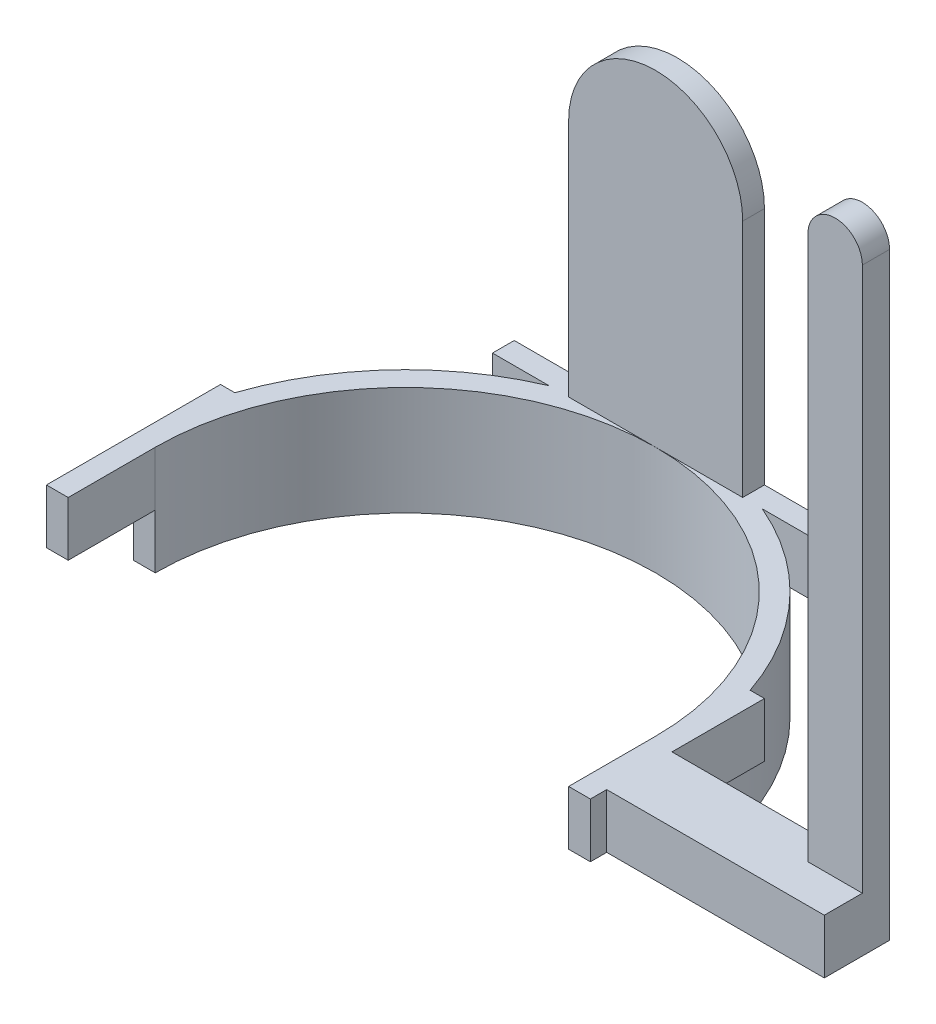
ISO-10303-21;
HEADER;
FILE_DESCRIPTION(('STEP AP214'),'2;1');
FILE_NAME('part.step','',(''),(''),'','','');
FILE_SCHEMA(('AUTOMOTIVE_DESIGN { 1 0 10303 214 1 1 1 1 }'));
ENDSEC;
DATA;
#1=APPLICATION_CONTEXT('core data for automotive mechanical design processes');
#2=APPLICATION_PROTOCOL_DEFINITION('international standard','automotive_design',2000,#1);
#3=PRODUCT_CONTEXT('',#1,'mechanical');
#4=PRODUCT('Part','Part','',(#3));
#5=PRODUCT_RELATED_PRODUCT_CATEGORY('part','',(#4));
#6=PRODUCT_DEFINITION_FORMATION('','',#4);
#7=PRODUCT_DEFINITION_CONTEXT('part definition',#1,'design');
#8=PRODUCT_DEFINITION('design','',#6,#7);
#9=PRODUCT_DEFINITION_SHAPE('','',#8);
#10=(LENGTH_UNIT() NAMED_UNIT(*) SI_UNIT(.MILLI.,.METRE.));
#11=(NAMED_UNIT(*) PLANE_ANGLE_UNIT() SI_UNIT($,.RADIAN.));
#12=(NAMED_UNIT(*) SI_UNIT($,.STERADIAN.) SOLID_ANGLE_UNIT());
#13=UNCERTAINTY_MEASURE_WITH_UNIT(LENGTH_MEASURE(1.E-05),#10,'distance_accuracy_value','');
#14=(GEOMETRIC_REPRESENTATION_CONTEXT(3) GLOBAL_UNCERTAINTY_ASSIGNED_CONTEXT((#13)) GLOBAL_UNIT_ASSIGNED_CONTEXT((#10,
#11,#12)) REPRESENTATION_CONTEXT('',''));
#15=CARTESIAN_POINT('',(0.,0.,0.));
#16=DIRECTION('',(0.,0.,1.));
#17=DIRECTION('',(1.,0.,0.));
#18=AXIS2_PLACEMENT_3D('',#15,#16,#17);
#19=CARTESIAN_POINT('',(0.,20.,0.));
#20=DIRECTION('',(0.,-1.,0.));
#21=DIRECTION('',(0.,0.,-1.));
#22=AXIS2_PLACEMENT_3D('',#19,#20,#21);
#23=PLANE('',#22);
#24=DIRECTION('',(0.,0.,1.));
#25=VECTOR('',#24,1.);
#26=CARTESIAN_POINT('',(80.,20.,1.));
#27=LINE('',#26,#25);
#28=CARTESIAN_POINT('',(80.,20.,1.));
#29=VERTEX_POINT('',#28);
#30=CARTESIAN_POINT('',(80.,20.,6.));
#31=VERTEX_POINT('',#30);
#32=EDGE_CURVE('E267',#29,#31,#27,.T.);
#33=ORIENTED_EDGE('',*,*,#32,.F.);
#34=DIRECTION('',(-1.,0.,0.));
#35=VECTOR('',#34,1.);
#36=CARTESIAN_POINT('',(90.,20.,0.999999999999999));
#37=LINE('',#36,#35);
#38=CARTESIAN_POINT('',(50.,20.,1.));
#39=VERTEX_POINT('',#38);
#40=EDGE_CURVE('E63',#29,#39,#37,.T.);
#41=ORIENTED_EDGE('',*,*,#40,.T.);
#42=DIRECTION('',(0.,0.,-1.));
#43=VECTOR('',#42,1.);
#44=CARTESIAN_POINT('',(50.,20.,-16.));
#45=LINE('',#44,#43);
#46=CARTESIAN_POINT('',(50.,20.,-16.));
#47=VERTEX_POINT('',#46);
#48=EDGE_CURVE('E344',#39,#47,#45,.T.);
#49=ORIENTED_EDGE('',*,*,#48,.T.);
#50=DIRECTION('',(-1.,0.,0.));
#51=VECTOR('',#50,1.);
#52=CARTESIAN_POINT('',(50.,20.,-16.));
#53=LINE('',#52,#51);
#54=CARTESIAN_POINT('',(47.370877129308,20.,-16.));
#55=VERTEX_POINT('',#54);
#56=EDGE_CURVE('E348',#47,#55,#53,.T.);
#57=ORIENTED_EDGE('',*,*,#56,.T.);
#58=CARTESIAN_POINT('',(0.,20.,0.));
#59=DIRECTION('',(0.,1.,0.));
#60=DIRECTION('',(0.,0.,-1.));
#61=AXIS2_PLACEMENT_3D('',#58,#59,#60);
#62=CIRCLE('',#61,50.);
#63=CARTESIAN_POINT('',(19.5959179422654,20.,-46.));
#64=VERTEX_POINT('',#63);
#65=EDGE_CURVE('E350',#55,#64,#62,.T.);
#66=ORIENTED_EDGE('',*,*,#65,.T.);
#67=DIRECTION('',(1.,0.,0.));
#68=VECTOR('',#67,1.);
#69=CARTESIAN_POINT('',(19.5959179422654,20.,-46.));
#70=LINE('',#69,#68);
#71=CARTESIAN_POINT('',(30.,20.,-46.));
#72=VERTEX_POINT('',#71);
#73=EDGE_CURVE('E352',#64,#72,#70,.T.);
#74=ORIENTED_EDGE('',*,*,#73,.T.);
#75=DIRECTION('',(0.,0.,-1.));
#76=VECTOR('',#75,1.);
#77=CARTESIAN_POINT('',(30.,20.,-50.));
#78=LINE('',#77,#76);
#79=CARTESIAN_POINT('',(30.,20.,-50.));
#80=VERTEX_POINT('',#79);
#81=EDGE_CURVE('E354',#72,#80,#78,.T.);
#82=ORIENTED_EDGE('',*,*,#81,.T.);
#83=DIRECTION('',(-1.,0.,0.));
#84=VECTOR('',#83,1.);
#85=CARTESIAN_POINT('',(-30.,20.,-50.));
#86=LINE('',#85,#84);
#87=CARTESIAN_POINT('',(16.,20.,-50.));
#88=VERTEX_POINT('',#87);
#89=EDGE_CURVE('E357',#80,#88,#86,.T.);
#90=ORIENTED_EDGE('',*,*,#89,.T.);
#91=DIRECTION('',(0.,0.,-1.));
#92=VECTOR('',#91,1.);
#93=CARTESIAN_POINT('',(16.,20.,-50.));
#94=LINE('',#93,#92);
#95=CARTESIAN_POINT('',(16.,20.,-46.));
#96=VERTEX_POINT('',#95);
#97=EDGE_CURVE('E312',#96,#88,#94,.T.);
#98=ORIENTED_EDGE('',*,*,#97,.F.);
#99=DIRECTION('',(1.,0.,0.));
#100=VECTOR('',#99,1.);
#101=CARTESIAN_POINT('',(-16.,20.,-46.));
#102=LINE('',#101,#100);
#103=CARTESIAN_POINT('',(0.,20.,-46.));
#104=VERTEX_POINT('',#103);
#105=EDGE_CURVE('E11',#104,#96,#102,.T.);
#106=ORIENTED_EDGE('',*,*,#105,.F.);
#107=CARTESIAN_POINT('',(0.,20.,0.));
#108=DIRECTION('',(0.,-1.,0.));
#109=DIRECTION('',(0.,0.,-1.));
#110=AXIS2_PLACEMENT_3D('',#107,#108,#109);
#111=CIRCLE('',#110,46.);
#112=CARTESIAN_POINT('',(46.,20.,0.));
#113=VERTEX_POINT('',#112);
#114=EDGE_CURVE('E336',#104,#113,#111,.T.);
#115=ORIENTED_EDGE('',*,*,#114,.T.);
#116=DIRECTION('',(0.,0.,1.));
#117=VECTOR('',#116,1.);
#118=CARTESIAN_POINT('',(46.,20.,0.));
#119=LINE('',#118,#117);
#120=CARTESIAN_POINT('',(46.,20.,16.));
#121=VERTEX_POINT('',#120);
#122=EDGE_CURVE('E340',#113,#121,#119,.T.);
#123=ORIENTED_EDGE('',*,*,#122,.T.);
#124=DIRECTION('',(1.,0.,0.));
#125=VECTOR('',#124,1.);
#126=CARTESIAN_POINT('',(50.,20.,16.));
#127=LINE('',#126,#125);
#128=CARTESIAN_POINT('',(50.,20.,16.));
#129=VERTEX_POINT('',#128);
#130=EDGE_CURVE('E342',#121,#129,#127,.T.);
#131=ORIENTED_EDGE('',*,*,#130,.T.);
#132=CARTESIAN_POINT('',(50.,20.,13.));
#133=VERTEX_POINT('',#132);
#134=EDGE_CURVE('E345',#129,#133,#45,.T.);
#135=ORIENTED_EDGE('',*,*,#134,.T.);
#136=DIRECTION('',(-1.,0.,0.));
#137=VECTOR('',#136,1.);
#138=CARTESIAN_POINT('',(90.,20.,13.));
#139=LINE('',#138,#137);
#140=CARTESIAN_POINT('',(90.,20.,13.));
#141=VERTEX_POINT('',#140);
#142=EDGE_CURVE('E286',#141,#133,#139,.T.);
#143=ORIENTED_EDGE('',*,*,#142,.F.);
#144=DIRECTION('',(0.,0.,1.));
#145=VECTOR('',#144,1.);
#146=CARTESIAN_POINT('',(90.,20.,13.));
#147=LINE('',#146,#145);
#148=CARTESIAN_POINT('',(90.,20.,6.));
#149=VERTEX_POINT('',#148);
#150=EDGE_CURVE('E284',#149,#141,#147,.T.);
#151=ORIENTED_EDGE('',*,*,#150,.F.);
#152=DIRECTION('',(1.,0.,0.));
#153=VECTOR('',#152,1.);
#154=CARTESIAN_POINT('',(90.,20.,6.));
#155=LINE('',#154,#153);
#156=EDGE_CURVE('E270',#31,#149,#155,.T.);
#157=ORIENTED_EDGE('',*,*,#156,.F.);
#158=EDGE_LOOP('',(#33,#41,#49,#57,#66,#74,#82,#90,#98,#106,#115,#123,#131,#135,#143,#151,#157));
#159=FACE_BOUND('',#158,.T.);
#160=ADVANCED_FACE('F38',(#159),#23,.F.);
#161=CARTESIAN_POINT('',(50.,20.,-16.));
#162=DIRECTION('',(-1.,0.,0.));
#163=DIRECTION('',(0.,0.,1.));
#164=AXIS2_PLACEMENT_3D('',#161,#162,#163);
#165=PLANE('',#164);
#166=DIRECTION('',(0.,-1.,0.));
#167=VECTOR('',#166,1.);
#168=CARTESIAN_POINT('',(50.,20.,13.));
#169=LINE('',#168,#167);
#170=CARTESIAN_POINT('',(50.,10.,13.));
#171=VERTEX_POINT('',#170);
#172=EDGE_CURVE('E261',#133,#171,#169,.T.);
#173=ORIENTED_EDGE('',*,*,#172,.F.);
#174=ORIENTED_EDGE('',*,*,#134,.F.);
#175=DIRECTION('',(0.,-1.,0.));
#176=VECTOR('',#175,1.);
#177=CARTESIAN_POINT('',(50.,20.,16.));
#178=LINE('',#177,#176);
#179=CARTESIAN_POINT('',(50.,10.,16.));
#180=VERTEX_POINT('',#179);
#181=EDGE_CURVE('E421',#129,#180,#178,.T.);
#182=ORIENTED_EDGE('',*,*,#181,.T.);
#183=DIRECTION('',(0.,0.,-1.));
#184=VECTOR('',#183,1.);
#185=CARTESIAN_POINT('',(50.,10.,-16.));
#186=LINE('',#185,#184);
#187=EDGE_CURVE('E380',#180,#171,#186,.T.);
#188=ORIENTED_EDGE('',*,*,#187,.T.);
#189=EDGE_LOOP('',(#173,#174,#182,#188));
#190=FACE_BOUND('',#189,.T.);
#191=ADVANCED_FACE('F507',(#190),#165,.F.);
#192=DIRECTION('',(0.,1.,0.));
#193=VECTOR('',#192,1.);
#194=CARTESIAN_POINT('',(50.,20.,0.999999999999999));
#195=LINE('',#194,#193);
#196=CARTESIAN_POINT('',(50.,10.,0.999999999999997));
#197=VERTEX_POINT('',#196);
#198=EDGE_CURVE('E280',#197,#39,#195,.T.);
#199=ORIENTED_EDGE('',*,*,#198,.F.);
#200=CARTESIAN_POINT('',(50.,10.,0.));
#201=VERTEX_POINT('',#200);
#202=EDGE_CURVE('E383',#197,#201,#186,.T.);
#203=ORIENTED_EDGE('',*,*,#202,.T.);
#204=CARTESIAN_POINT('',(50.,10.,-16.));
#205=VERTEX_POINT('',#204);
#206=EDGE_CURVE('E379',#201,#205,#186,.T.);
#207=ORIENTED_EDGE('',*,*,#206,.T.);
#208=DIRECTION('',(0.,-1.,0.));
#209=VECTOR('',#208,1.);
#210=CARTESIAN_POINT('',(50.,20.,-16.));
#211=LINE('',#210,#209);
#212=EDGE_CURVE('E418',#47,#205,#211,.T.);
#213=ORIENTED_EDGE('',*,*,#212,.F.);
#214=ORIENTED_EDGE('',*,*,#48,.F.);
#215=EDGE_LOOP('',(#199,#203,#207,#213,#214));
#216=FACE_BOUND('',#215,.T.);
#217=ADVANCED_FACE('F521',(#216),#165,.F.);
#218=CARTESIAN_POINT('',(-16.,80.,-50.));
#219=DIRECTION('',(1.,0.,0.));
#220=DIRECTION('',(0.,0.,-1.));
#221=AXIS2_PLACEMENT_3D('',#218,#219,#220);
#222=PLANE('',#221);
#223=DIRECTION('',(0.,0.,-1.));
#224=VECTOR('',#223,1.);
#225=CARTESIAN_POINT('',(-16.,64.,-20.));
#226=LINE('',#225,#224);
#227=CARTESIAN_POINT('',(-16.,64.,-46.));
#228=VERTEX_POINT('',#227);
#229=CARTESIAN_POINT('',(-16.,64.,-50.));
#230=VERTEX_POINT('',#229);
#231=EDGE_CURVE('E301',#228,#230,#226,.T.);
#232=ORIENTED_EDGE('',*,*,#231,.T.);
#233=DIRECTION('',(0.,-1.,0.));
#234=VECTOR('',#233,1.);
#235=CARTESIAN_POINT('',(-16.,80.,-50.));
#236=LINE('',#235,#234);
#237=CARTESIAN_POINT('',(-16.,20.,-50.));
#238=VERTEX_POINT('',#237);
#239=EDGE_CURVE('E315',#230,#238,#236,.T.);
#240=ORIENTED_EDGE('',*,*,#239,.T.);
#241=DIRECTION('',(0.,0.,1.));
#242=VECTOR('',#241,1.);
#243=CARTESIAN_POINT('',(-16.,20.,-50.));
#244=LINE('',#243,#242);
#245=CARTESIAN_POINT('',(-16.,20.,-46.));
#246=VERTEX_POINT('',#245);
#247=EDGE_CURVE('E308',#238,#246,#244,.T.);
#248=ORIENTED_EDGE('',*,*,#247,.T.);
#249=DIRECTION('',(0.,-1.,0.));
#250=VECTOR('',#249,1.);
#251=CARTESIAN_POINT('',(-16.,80.,-46.));
#252=LINE('',#251,#250);
#253=EDGE_CURVE('E321',#228,#246,#252,.T.);
#254=ORIENTED_EDGE('',*,*,#253,.F.);
#255=EDGE_LOOP('',(#232,#240,#248,#254));
#256=FACE_BOUND('',#255,.T.);
#257=ADVANCED_FACE('F563',(#256),#222,.F.);
#258=ORIENTED_EDGE('',*,*,#247,.F.);
#259=CARTESIAN_POINT('',(-30.,20.,-50.));
#260=VERTEX_POINT('',#259);
#261=EDGE_CURVE('E356',#238,#260,#86,.T.);
#262=ORIENTED_EDGE('',*,*,#261,.T.);
#263=DIRECTION('',(0.,0.,1.));
#264=VECTOR('',#263,1.);
#265=CARTESIAN_POINT('',(-30.,20.,-50.));
#266=LINE('',#265,#264);
#267=CARTESIAN_POINT('',(-30.,20.,-46.));
#268=VERTEX_POINT('',#267);
#269=EDGE_CURVE('E360',#260,#268,#266,.T.);
#270=ORIENTED_EDGE('',*,*,#269,.T.);
#271=DIRECTION('',(1.,0.,0.));
#272=VECTOR('',#271,1.);
#273=CARTESIAN_POINT('',(-30.,20.,-46.));
#274=LINE('',#273,#272);
#275=CARTESIAN_POINT('',(-19.5959179422654,20.,-46.));
#276=VERTEX_POINT('',#275);
#277=EDGE_CURVE('E362',#268,#276,#274,.T.);
#278=ORIENTED_EDGE('',*,*,#277,.T.);
#279=CARTESIAN_POINT('',(0.,20.,0.));
#280=DIRECTION('',(0.,1.,0.));
#281=DIRECTION('',(0.,0.,-1.));
#282=AXIS2_PLACEMENT_3D('',#279,#280,#281);
#283=CIRCLE('',#282,50.);
#284=CARTESIAN_POINT('',(-47.370877129308,20.,-16.));
#285=VERTEX_POINT('',#284);
#286=EDGE_CURVE('E324',#276,#285,#283,.T.);
#287=ORIENTED_EDGE('',*,*,#286,.T.);
#288=DIRECTION('',(-1.,0.,0.));
#289=VECTOR('',#288,1.);
#290=CARTESIAN_POINT('',(-50.,20.,-16.));
#291=LINE('',#290,#289);
#292=CARTESIAN_POINT('',(-50.,20.,-16.));
#293=VERTEX_POINT('',#292);
#294=EDGE_CURVE('E327',#285,#293,#291,.T.);
#295=ORIENTED_EDGE('',*,*,#294,.T.);
#296=DIRECTION('',(0.,0.,1.));
#297=VECTOR('',#296,1.);
#298=CARTESIAN_POINT('',(-50.,20.,-16.));
#299=LINE('',#298,#297);
#300=CARTESIAN_POINT('',(-50.,20.,16.));
#301=VERTEX_POINT('',#300);
#302=EDGE_CURVE('E330',#293,#301,#299,.T.);
#303=ORIENTED_EDGE('',*,*,#302,.T.);
#304=DIRECTION('',(1.,0.,0.));
#305=VECTOR('',#304,1.);
#306=CARTESIAN_POINT('',(-50.,20.,16.));
#307=LINE('',#306,#305);
#308=CARTESIAN_POINT('',(-46.,20.,16.));
#309=VERTEX_POINT('',#308);
#310=EDGE_CURVE('E332',#301,#309,#307,.T.);
#311=ORIENTED_EDGE('',*,*,#310,.T.);
#312=DIRECTION('',(0.,0.,-1.));
#313=VECTOR('',#312,1.);
#314=CARTESIAN_POINT('',(-46.,20.,0.));
#315=LINE('',#314,#313);
#316=CARTESIAN_POINT('',(-46.,20.,0.));
#317=VERTEX_POINT('',#316);
#318=EDGE_CURVE('E334',#309,#317,#315,.T.);
#319=ORIENTED_EDGE('',*,*,#318,.T.);
#320=EDGE_CURVE('E337',#317,#104,#111,.T.);
#321=ORIENTED_EDGE('',*,*,#320,.T.);
#322=EDGE_CURVE('E48',#246,#104,#102,.T.);
#323=ORIENTED_EDGE('',*,*,#322,.F.);
#324=EDGE_LOOP('',(#258,#262,#270,#278,#287,#295,#303,#311,#319,#321,#323));
#325=FACE_BOUND('',#324,.T.);
#326=ADVANCED_FACE('F559',(#325),#23,.F.);
#327=CARTESIAN_POINT('',(0.,10.,0.));
#328=DIRECTION('',(0.,-1.,0.));
#329=DIRECTION('',(0.,0.,-1.));
#330=AXIS2_PLACEMENT_3D('',#327,#328,#329);
#331=CYLINDRICAL_SURFACE('',#330,50.);
#332=CARTESIAN_POINT('',(0.,0.,0.));
#333=DIRECTION('',(0.,1.,0.));
#334=DIRECTION('',(0.,0.,-1.));
#335=AXIS2_PLACEMENT_3D('',#332,#333,#334);
#336=CIRCLE('',#335,50.);
#337=CARTESIAN_POINT('',(50.,0.,0.));
#338=VERTEX_POINT('',#337);
#339=CARTESIAN_POINT('',(-50.,0.,0.));
#340=VERTEX_POINT('',#339);
#341=EDGE_CURVE('E445',#338,#340,#336,.T.);
#342=ORIENTED_EDGE('',*,*,#341,.T.);
#343=DIRECTION('',(0.,-1.,0.));
#344=VECTOR('',#343,1.);
#345=CARTESIAN_POINT('',(-50.,10.,0.));
#346=LINE('',#345,#344);
#347=CARTESIAN_POINT('',(-50.,10.,0.));
#348=VERTEX_POINT('',#347);
#349=EDGE_CURVE('E42',#348,#340,#346,.T.);
#350=ORIENTED_EDGE('',*,*,#349,.F.);
#351=CARTESIAN_POINT('',(0.,10.,0.));
#352=DIRECTION('',(0.,1.,0.));
#353=DIRECTION('',(0.,0.,-1.));
#354=AXIS2_PLACEMENT_3D('',#351,#352,#353);
#355=CIRCLE('',#354,50.);
#356=CARTESIAN_POINT('',(-47.370877129308,10.,-16.));
#357=VERTEX_POINT('',#356);
#358=EDGE_CURVE('E450',#357,#348,#355,.T.);
#359=ORIENTED_EDGE('',*,*,#358,.F.);
#360=DIRECTION('',(0.,-1.,0.));
#361=VECTOR('',#360,1.);
#362=CARTESIAN_POINT('',(-47.370877129308,20.,-16.));
#363=LINE('',#362,#361);
#364=EDGE_CURVE('E442',#285,#357,#363,.T.);
#365=ORIENTED_EDGE('',*,*,#364,.F.);
#366=ORIENTED_EDGE('',*,*,#286,.F.);
#367=DIRECTION('',(0.,-1.,0.));
#368=VECTOR('',#367,1.);
#369=CARTESIAN_POINT('',(-19.5959179422654,20.,-46.));
#370=LINE('',#369,#368);
#371=CARTESIAN_POINT('',(-19.5959179422654,10.,-46.));
#372=VERTEX_POINT('',#371);
#373=EDGE_CURVE('E364',#276,#372,#370,.T.);
#374=ORIENTED_EDGE('',*,*,#373,.T.);
#375=CARTESIAN_POINT('',(0.,10.,-50.));
#376=VERTEX_POINT('',#375);
#377=EDGE_CURVE('E602',#376,#372,#355,.T.);
#378=ORIENTED_EDGE('',*,*,#377,.F.);
#379=CARTESIAN_POINT('',(19.5959179422654,10.,-46.));
#380=VERTEX_POINT('',#379);
#381=EDGE_CURVE('E449',#380,#376,#355,.T.);
#382=ORIENTED_EDGE('',*,*,#381,.F.);
#383=DIRECTION('',(0.,-1.,0.));
#384=VECTOR('',#383,1.);
#385=CARTESIAN_POINT('',(19.5959179422654,20.,-46.));
#386=LINE('',#385,#384);
#387=EDGE_CURVE('E412',#64,#380,#386,.T.);
#388=ORIENTED_EDGE('',*,*,#387,.F.);
#389=ORIENTED_EDGE('',*,*,#65,.F.);
#390=DIRECTION('',(0.,-1.,0.));
#391=VECTOR('',#390,1.);
#392=CARTESIAN_POINT('',(47.370877129308,20.,-16.));
#393=LINE('',#392,#391);
#394=CARTESIAN_POINT('',(47.370877129308,10.,-16.));
#395=VERTEX_POINT('',#394);
#396=EDGE_CURVE('E415',#55,#395,#393,.T.);
#397=ORIENTED_EDGE('',*,*,#396,.T.);
#398=EDGE_CURVE('E446',#201,#395,#355,.T.);
#399=ORIENTED_EDGE('',*,*,#398,.F.);
#400=DIRECTION('',(0.,-1.,0.));
#401=VECTOR('',#400,1.);
#402=CARTESIAN_POINT('',(50.,10.,0.));
#403=LINE('',#402,#401);
#404=EDGE_CURVE('E456',#201,#338,#403,.T.);
#405=ORIENTED_EDGE('',*,*,#404,.T.);
#406=EDGE_LOOP('',(#342,#350,#359,#365,#366,#374,#378,#382,#388,#389,#397,#399,#405));
#407=FACE_BOUND('',#406,.T.);
#408=ADVANCED_FACE('F40',(#407),#331,.T.);
#409=CARTESIAN_POINT('',(-50.,10.,0.));
#410=DIRECTION('',(0.,0.,-1.));
#411=DIRECTION('',(-1.,0.,0.));
#412=AXIS2_PLACEMENT_3D('',#409,#410,#411);
#413=PLANE('',#412);
#414=DIRECTION('',(1.,0.,0.));
#415=VECTOR('',#414,1.);
#416=CARTESIAN_POINT('',(-50.,0.,0.));
#417=LINE('',#416,#415);
#418=CARTESIAN_POINT('',(-46.,0.,0.));
#419=VERTEX_POINT('',#418);
#420=EDGE_CURVE('E459',#340,#419,#417,.T.);
#421=ORIENTED_EDGE('',*,*,#420,.T.);
#422=DIRECTION('',(0.,-1.,0.));
#423=VECTOR('',#422,1.);
#424=CARTESIAN_POINT('',(-46.,10.,0.));
#425=LINE('',#424,#423);
#426=CARTESIAN_POINT('',(-46.,10.,0.));
#427=VERTEX_POINT('',#426);
#428=EDGE_CURVE('E469',#427,#419,#425,.T.);
#429=ORIENTED_EDGE('',*,*,#428,.F.);
#430=DIRECTION('',(1.,0.,0.));
#431=VECTOR('',#430,1.);
#432=CARTESIAN_POINT('',(-50.,10.,0.));
#433=LINE('',#432,#431);
#434=EDGE_CURVE('E448',#348,#427,#433,.T.);
#435=ORIENTED_EDGE('',*,*,#434,.F.);
#436=ORIENTED_EDGE('',*,*,#349,.T.);
#437=EDGE_LOOP('',(#421,#429,#435,#436));
#438=FACE_BOUND('',#437,.T.);
#439=ADVANCED_FACE('F476',(#438),#413,.F.);
#440=CARTESIAN_POINT('',(0.,10.,0.));
#441=DIRECTION('',(0.,-1.,0.));
#442=DIRECTION('',(0.,0.,-1.));
#443=AXIS2_PLACEMENT_3D('',#440,#441,#442);
#444=CYLINDRICAL_SURFACE('',#443,46.);
#445=CARTESIAN_POINT('',(0.,0.,0.));
#446=DIRECTION('',(0.,-1.,0.));
#447=DIRECTION('',(0.,0.,-1.));
#448=AXIS2_PLACEMENT_3D('',#445,#446,#447);
#449=CIRCLE('',#448,46.);
#450=CARTESIAN_POINT('',(46.,0.,0.));
#451=VERTEX_POINT('',#450);
#452=EDGE_CURVE('E461',#419,#451,#449,.T.);
#453=ORIENTED_EDGE('',*,*,#452,.T.);
#454=DIRECTION('',(0.,-1.,0.));
#455=VECTOR('',#454,1.);
#456=CARTESIAN_POINT('',(46.,10.,0.));
#457=LINE('',#456,#455);
#458=CARTESIAN_POINT('',(46.,10.,0.));
#459=VERTEX_POINT('',#458);
#460=EDGE_CURVE('E467',#459,#451,#457,.T.);
#461=ORIENTED_EDGE('',*,*,#460,.F.);
#462=DIRECTION('',(0.,-1.,0.));
#463=VECTOR('',#462,1.);
#464=CARTESIAN_POINT('',(46.,20.,0.));
#465=LINE('',#464,#463);
#466=EDGE_CURVE('E427',#113,#459,#465,.T.);
#467=ORIENTED_EDGE('',*,*,#466,.F.);
#468=ORIENTED_EDGE('',*,*,#114,.F.);
#469=ORIENTED_EDGE('',*,*,#320,.F.);
#470=DIRECTION('',(0.,-1.,0.));
#471=VECTOR('',#470,1.);
#472=CARTESIAN_POINT('',(-46.,20.,0.));
#473=LINE('',#472,#471);
#474=EDGE_CURVE('E430',#317,#427,#473,.T.);
#475=ORIENTED_EDGE('',*,*,#474,.T.);
#476=ORIENTED_EDGE('',*,*,#428,.T.);
#477=EDGE_LOOP('',(#453,#461,#467,#468,#469,#475,#476));
#478=FACE_BOUND('',#477,.T.);
#479=ADVANCED_FACE('F485',(#478),#444,.F.);
#480=CARTESIAN_POINT('',(46.,10.,0.));
#481=DIRECTION('',(0.,0.,-1.));
#482=DIRECTION('',(-1.,0.,0.));
#483=AXIS2_PLACEMENT_3D('',#480,#481,#482);
#484=PLANE('',#483);
#485=DIRECTION('',(1.,0.,0.));
#486=VECTOR('',#485,1.);
#487=CARTESIAN_POINT('',(46.,0.,0.));
#488=LINE('',#487,#486);
#489=EDGE_CURVE('E463',#451,#338,#488,.T.);
#490=ORIENTED_EDGE('',*,*,#489,.T.);
#491=ORIENTED_EDGE('',*,*,#404,.F.);
#492=DIRECTION('',(1.,0.,0.));
#493=VECTOR('',#492,1.);
#494=CARTESIAN_POINT('',(46.,10.,0.));
#495=LINE('',#494,#493);
#496=EDGE_CURVE('E453',#459,#201,#495,.T.);
#497=ORIENTED_EDGE('',*,*,#496,.F.);
#498=ORIENTED_EDGE('',*,*,#460,.T.);
#499=EDGE_LOOP('',(#490,#491,#497,#498));
#500=FACE_BOUND('',#499,.T.);
#501=ADVANCED_FACE('F489',(#500),#484,.F.);
#502=CARTESIAN_POINT('',(0.,0.,0.));
#503=DIRECTION('',(0.,-1.,0.));
#504=DIRECTION('',(0.,0.,-1.));
#505=AXIS2_PLACEMENT_3D('',#502,#503,#504);
#506=PLANE('',#505);
#507=ORIENTED_EDGE('',*,*,#341,.F.);
#508=ORIENTED_EDGE('',*,*,#489,.F.);
#509=ORIENTED_EDGE('',*,*,#452,.F.);
#510=ORIENTED_EDGE('',*,*,#420,.F.);
#511=EDGE_LOOP('',(#507,#508,#509,#510));
#512=FACE_BOUND('',#511,.T.);
#513=ADVANCED_FACE('F484',(#512),#506,.T.);
#514=CARTESIAN_POINT('',(0.,10.,0.));
#515=DIRECTION('',(0.,-1.,0.));
#516=DIRECTION('',(0.,0.,-1.));
#517=AXIS2_PLACEMENT_3D('',#514,#515,#516);
#518=PLANE('',#517);
#519=DIRECTION('',(1.,0.,0.));
#520=VECTOR('',#519,1.);
#521=CARTESIAN_POINT('',(19.5959179422654,10.,-46.));
#522=LINE('',#521,#520);
#523=CARTESIAN_POINT('',(30.,10.,-46.));
#524=VERTEX_POINT('',#523);
#525=EDGE_CURVE('E386',#380,#524,#522,.T.);
#526=ORIENTED_EDGE('',*,*,#525,.F.);
#527=ORIENTED_EDGE('',*,*,#381,.T.);
#528=DIRECTION('',(-1.,0.,0.));
#529=VECTOR('',#528,1.);
#530=CARTESIAN_POINT('',(-30.,10.,-50.));
#531=LINE('',#530,#529);
#532=CARTESIAN_POINT('',(30.,10.,-50.));
#533=VERTEX_POINT('',#532);
#534=EDGE_CURVE('E391',#533,#376,#531,.T.);
#535=ORIENTED_EDGE('',*,*,#534,.F.);
#536=DIRECTION('',(0.,0.,-1.));
#537=VECTOR('',#536,1.);
#538=CARTESIAN_POINT('',(30.,10.,-50.));
#539=LINE('',#538,#537);
#540=EDGE_CURVE('E388',#524,#533,#539,.T.);
#541=ORIENTED_EDGE('',*,*,#540,.F.);
#542=EDGE_LOOP('',(#526,#527,#535,#541));
#543=FACE_BOUND('',#542,.T.);
#544=ADVANCED_FACE('F606',(#543),#518,.T.);
#545=CARTESIAN_POINT('',(-30.,10.,-50.));
#546=VERTEX_POINT('',#545);
#547=EDGE_CURVE('E390',#376,#546,#531,.T.);
#548=ORIENTED_EDGE('',*,*,#547,.F.);
#549=ORIENTED_EDGE('',*,*,#377,.T.);
#550=DIRECTION('',(1.,0.,0.));
#551=VECTOR('',#550,1.);
#552=CARTESIAN_POINT('',(-30.,10.,-46.));
#553=LINE('',#552,#551);
#554=CARTESIAN_POINT('',(-30.,10.,-46.));
#555=VERTEX_POINT('',#554);
#556=EDGE_CURVE('E328',#555,#372,#553,.T.);
#557=ORIENTED_EDGE('',*,*,#556,.F.);
#558=DIRECTION('',(0.,0.,1.));
#559=VECTOR('',#558,1.);
#560=CARTESIAN_POINT('',(-30.,10.,-50.));
#561=LINE('',#560,#559);
#562=EDGE_CURVE('E394',#546,#555,#561,.T.);
#563=ORIENTED_EDGE('',*,*,#562,.F.);
#564=EDGE_LOOP('',(#548,#549,#557,#563));
#565=FACE_BOUND('',#564,.T.);
#566=ADVANCED_FACE('F607',(#565),#518,.T.);
#567=DIRECTION('',(-1.,0.,0.));
#568=VECTOR('',#567,1.);
#569=CARTESIAN_POINT('',(-50.,10.,-16.));
#570=LINE('',#569,#568);
#571=CARTESIAN_POINT('',(-50.,10.,-16.));
#572=VERTEX_POINT('',#571);
#573=EDGE_CURVE('E323',#357,#572,#570,.T.);
#574=ORIENTED_EDGE('',*,*,#573,.F.);
#575=ORIENTED_EDGE('',*,*,#358,.T.);
#576=DIRECTION('',(0.,0.,1.));
#577=VECTOR('',#576,1.);
#578=CARTESIAN_POINT('',(-50.,10.,-16.));
#579=LINE('',#578,#577);
#580=EDGE_CURVE('E367',#572,#348,#579,.T.);
#581=ORIENTED_EDGE('',*,*,#580,.F.);
#582=EDGE_LOOP('',(#574,#575,#581));
#583=FACE_BOUND('',#582,.T.);
#584=ADVANCED_FACE('F601',(#583),#518,.T.);
#585=CARTESIAN_POINT('',(-50.,10.,16.));
#586=VERTEX_POINT('',#585);
#587=EDGE_CURVE('E366',#348,#586,#579,.T.);
#588=ORIENTED_EDGE('',*,*,#587,.F.);
#589=ORIENTED_EDGE('',*,*,#434,.T.);
#590=DIRECTION('',(0.,0.,-1.));
#591=VECTOR('',#590,1.);
#592=CARTESIAN_POINT('',(-46.,10.,0.));
#593=LINE('',#592,#591);
#594=CARTESIAN_POINT('',(-46.,10.,16.));
#595=VERTEX_POINT('',#594);
#596=EDGE_CURVE('E372',#595,#427,#593,.T.);
#597=ORIENTED_EDGE('',*,*,#596,.F.);
#598=DIRECTION('',(1.,0.,0.));
#599=VECTOR('',#598,1.);
#600=CARTESIAN_POINT('',(-50.,10.,16.));
#601=LINE('',#600,#599);
#602=EDGE_CURVE('E370',#586,#595,#601,.T.);
#603=ORIENTED_EDGE('',*,*,#602,.F.);
#604=EDGE_LOOP('',(#588,#589,#597,#603));
#605=FACE_BOUND('',#604,.T.);
#606=ADVANCED_FACE('F599',(#605),#518,.T.);
#607=ORIENTED_EDGE('',*,*,#206,.F.);
#608=ORIENTED_EDGE('',*,*,#398,.T.);
#609=DIRECTION('',(-1.,0.,0.));
#610=VECTOR('',#609,1.);
#611=CARTESIAN_POINT('',(50.,10.,-16.));
#612=LINE('',#611,#610);
#613=EDGE_CURVE('E382',#205,#395,#612,.T.);
#614=ORIENTED_EDGE('',*,*,#613,.F.);
#615=EDGE_LOOP('',(#607,#608,#614));
#616=FACE_BOUND('',#615,.T.);
#617=ADVANCED_FACE('F692',(#616),#518,.T.);
#618=CARTESIAN_POINT('',(-50.,20.,-16.));
#619=DIRECTION('',(0.,0.,1.));
#620=DIRECTION('',(1.,0.,0.));
#621=AXIS2_PLACEMENT_3D('',#618,#619,#620);
#622=PLANE('',#621);
#623=ORIENTED_EDGE('',*,*,#573,.T.);
#624=DIRECTION('',(0.,-1.,0.));
#625=VECTOR('',#624,1.);
#626=CARTESIAN_POINT('',(-50.,20.,-16.));
#627=LINE('',#626,#625);
#628=EDGE_CURVE('E439',#293,#572,#627,.T.);
#629=ORIENTED_EDGE('',*,*,#628,.F.);
#630=ORIENTED_EDGE('',*,*,#294,.F.);
#631=ORIENTED_EDGE('',*,*,#364,.T.);
#632=EDGE_LOOP('',(#623,#629,#630,#631));
#633=FACE_BOUND('',#632,.T.);
#634=ADVANCED_FACE('F582',(#633),#622,.F.);
#635=CARTESIAN_POINT('',(-50.,20.,-16.));
#636=DIRECTION('',(1.,0.,0.));
#637=DIRECTION('',(0.,0.,-1.));
#638=AXIS2_PLACEMENT_3D('',#635,#636,#637);
#639=PLANE('',#638);
#640=ORIENTED_EDGE('',*,*,#580,.T.);
#641=ORIENTED_EDGE('',*,*,#587,.T.);
#642=DIRECTION('',(0.,-1.,0.));
#643=VECTOR('',#642,1.);
#644=CARTESIAN_POINT('',(-50.,20.,16.));
#645=LINE('',#644,#643);
#646=EDGE_CURVE('E436',#301,#586,#645,.T.);
#647=ORIENTED_EDGE('',*,*,#646,.F.);
#648=ORIENTED_EDGE('',*,*,#302,.F.);
#649=ORIENTED_EDGE('',*,*,#628,.T.);
#650=EDGE_LOOP('',(#640,#641,#647,#648,#649));
#651=FACE_BOUND('',#650,.T.);
#652=ADVANCED_FACE('F586',(#651),#639,.F.);
#653=CARTESIAN_POINT('',(-50.,20.,16.));
#654=DIRECTION('',(0.,0.,-1.));
#655=DIRECTION('',(-1.,0.,0.));
#656=AXIS2_PLACEMENT_3D('',#653,#654,#655);
#657=PLANE('',#656);
#658=ORIENTED_EDGE('',*,*,#602,.T.);
#659=DIRECTION('',(0.,-1.,0.));
#660=VECTOR('',#659,1.);
#661=CARTESIAN_POINT('',(-46.,20.,16.));
#662=LINE('',#661,#660);
#663=EDGE_CURVE('E433',#309,#595,#662,.T.);
#664=ORIENTED_EDGE('',*,*,#663,.F.);
#665=ORIENTED_EDGE('',*,*,#310,.F.);
#666=ORIENTED_EDGE('',*,*,#646,.T.);
#667=EDGE_LOOP('',(#658,#664,#665,#666));
#668=FACE_BOUND('',#667,.T.);
#669=ADVANCED_FACE('F592',(#668),#657,.F.);
#670=CARTESIAN_POINT('',(-46.,20.,0.));
#671=DIRECTION('',(-1.,0.,0.));
#672=DIRECTION('',(0.,0.,1.));
#673=AXIS2_PLACEMENT_3D('',#670,#671,#672);
#674=PLANE('',#673);
#675=ORIENTED_EDGE('',*,*,#596,.T.);
#676=ORIENTED_EDGE('',*,*,#474,.F.);
#677=ORIENTED_EDGE('',*,*,#318,.F.);
#678=ORIENTED_EDGE('',*,*,#663,.T.);
#679=EDGE_LOOP('',(#675,#676,#677,#678));
#680=FACE_BOUND('',#679,.T.);
#681=ADVANCED_FACE('F596',(#680),#674,.F.);
#682=CARTESIAN_POINT('',(46.,20.,0.));
#683=DIRECTION('',(1.,0.,0.));
#684=DIRECTION('',(0.,0.,-1.));
#685=AXIS2_PLACEMENT_3D('',#682,#683,#684);
#686=PLANE('',#685);
#687=DIRECTION('',(0.,0.,1.));
#688=VECTOR('',#687,1.);
#689=CARTESIAN_POINT('',(46.,10.,0.));
#690=LINE('',#689,#688);
#691=CARTESIAN_POINT('',(46.,10.,16.));
#692=VERTEX_POINT('',#691);
#693=EDGE_CURVE('E375',#459,#692,#690,.T.);
#694=ORIENTED_EDGE('',*,*,#693,.T.);
#695=DIRECTION('',(0.,-1.,0.));
#696=VECTOR('',#695,1.);
#697=CARTESIAN_POINT('',(46.,20.,16.));
#698=LINE('',#697,#696);
#699=EDGE_CURVE('E424',#121,#692,#698,.T.);
#700=ORIENTED_EDGE('',*,*,#699,.F.);
#701=ORIENTED_EDGE('',*,*,#122,.F.);
#702=ORIENTED_EDGE('',*,*,#466,.T.);
#703=EDGE_LOOP('',(#694,#700,#701,#702));
#704=FACE_BOUND('',#703,.T.);
#705=ADVANCED_FACE('F495',(#704),#686,.F.);
#706=CARTESIAN_POINT('',(50.,20.,16.));
#707=DIRECTION('',(0.,0.,-1.));
#708=DIRECTION('',(-1.,0.,0.));
#709=AXIS2_PLACEMENT_3D('',#706,#707,#708);
#710=PLANE('',#709);
#711=DIRECTION('',(1.,0.,0.));
#712=VECTOR('',#711,1.);
#713=CARTESIAN_POINT('',(50.,10.,16.));
#714=LINE('',#713,#712);
#715=EDGE_CURVE('E377',#692,#180,#714,.T.);
#716=ORIENTED_EDGE('',*,*,#715,.T.);
#717=ORIENTED_EDGE('',*,*,#181,.F.);
#718=ORIENTED_EDGE('',*,*,#130,.F.);
#719=ORIENTED_EDGE('',*,*,#699,.T.);
#720=EDGE_LOOP('',(#716,#717,#718,#719));
#721=FACE_BOUND('',#720,.T.);
#722=ADVANCED_FACE('F503',(#721),#710,.F.);
#723=CARTESIAN_POINT('',(50.,20.,-16.));
#724=DIRECTION('',(0.,0.,1.));
#725=DIRECTION('',(1.,0.,0.));
#726=AXIS2_PLACEMENT_3D('',#723,#724,#725);
#727=PLANE('',#726);
#728=ORIENTED_EDGE('',*,*,#613,.T.);
#729=ORIENTED_EDGE('',*,*,#396,.F.);
#730=ORIENTED_EDGE('',*,*,#56,.F.);
#731=ORIENTED_EDGE('',*,*,#212,.T.);
#732=EDGE_LOOP('',(#728,#729,#730,#731));
#733=FACE_BOUND('',#732,.T.);
#734=ADVANCED_FACE('F528',(#733),#727,.F.);
#735=CARTESIAN_POINT('',(19.5959179422654,20.,-46.));
#736=DIRECTION('',(0.,0.,-1.));
#737=DIRECTION('',(-1.,0.,0.));
#738=AXIS2_PLACEMENT_3D('',#735,#736,#737);
#739=PLANE('',#738);
#740=ORIENTED_EDGE('',*,*,#525,.T.);
#741=DIRECTION('',(0.,-1.,0.));
#742=VECTOR('',#741,1.);
#743=CARTESIAN_POINT('',(30.,20.,-46.));
#744=LINE('',#743,#742);
#745=EDGE_CURVE('E409',#72,#524,#744,.T.);
#746=ORIENTED_EDGE('',*,*,#745,.F.);
#747=ORIENTED_EDGE('',*,*,#73,.F.);
#748=ORIENTED_EDGE('',*,*,#387,.T.);
#749=EDGE_LOOP('',(#740,#746,#747,#748));
#750=FACE_BOUND('',#749,.T.);
#751=ADVANCED_FACE('F535',(#750),#739,.F.);
#752=CARTESIAN_POINT('',(30.,20.,-50.));
#753=DIRECTION('',(-1.,0.,0.));
#754=DIRECTION('',(0.,0.,1.));
#755=AXIS2_PLACEMENT_3D('',#752,#753,#754);
#756=PLANE('',#755);
#757=ORIENTED_EDGE('',*,*,#540,.T.);
#758=DIRECTION('',(0.,-1.,0.));
#759=VECTOR('',#758,1.);
#760=CARTESIAN_POINT('',(30.,20.,-50.));
#761=LINE('',#760,#759);
#762=EDGE_CURVE('E406',#80,#533,#761,.T.);
#763=ORIENTED_EDGE('',*,*,#762,.F.);
#764=ORIENTED_EDGE('',*,*,#81,.F.);
#765=ORIENTED_EDGE('',*,*,#745,.T.);
#766=EDGE_LOOP('',(#757,#763,#764,#765));
#767=FACE_BOUND('',#766,.T.);
#768=ADVANCED_FACE('F541',(#767),#756,.F.);
#769=CARTESIAN_POINT('',(-30.,20.,-50.));
#770=DIRECTION('',(0.,0.,1.));
#771=DIRECTION('',(1.,0.,0.));
#772=AXIS2_PLACEMENT_3D('',#769,#770,#771);
#773=PLANE('',#772);
#774=ORIENTED_EDGE('',*,*,#239,.F.);
#775=CARTESIAN_POINT('',(0.,64.,-50.));
#776=DIRECTION('',(0.,0.,1.));
#777=DIRECTION('',(-1.,0.,0.));
#778=AXIS2_PLACEMENT_3D('',#775,#776,#777);
#779=CIRCLE('',#778,16.);
#780=CARTESIAN_POINT('',(16.,64.,-50.));
#781=VERTEX_POINT('',#780);
#782=EDGE_CURVE('E299',#781,#230,#779,.T.);
#783=ORIENTED_EDGE('',*,*,#782,.F.);
#784=DIRECTION('',(0.,-1.,0.));
#785=VECTOR('',#784,1.);
#786=CARTESIAN_POINT('',(16.,80.,-50.));
#787=LINE('',#786,#785);
#788=EDGE_CURVE('E317',#781,#88,#787,.T.);
#789=ORIENTED_EDGE('',*,*,#788,.T.);
#790=ORIENTED_EDGE('',*,*,#89,.F.);
#791=ORIENTED_EDGE('',*,*,#762,.T.);
#792=ORIENTED_EDGE('',*,*,#534,.T.);
#793=ORIENTED_EDGE('',*,*,#547,.T.);
#794=DIRECTION('',(0.,-1.,0.));
#795=VECTOR('',#794,1.);
#796=CARTESIAN_POINT('',(-30.,20.,-50.));
#797=LINE('',#796,#795);
#798=EDGE_CURVE('E403',#260,#546,#797,.T.);
#799=ORIENTED_EDGE('',*,*,#798,.F.);
#800=ORIENTED_EDGE('',*,*,#261,.F.);
#801=EDGE_LOOP('',(#774,#783,#789,#790,#791,#792,#793,#799,#800));
#802=FACE_BOUND('',#801,.T.);
#803=ADVANCED_FACE('F546',(#802),#773,.F.);
#804=CARTESIAN_POINT('',(-30.,20.,-50.));
#805=DIRECTION('',(1.,0.,0.));
#806=DIRECTION('',(0.,0.,-1.));
#807=AXIS2_PLACEMENT_3D('',#804,#805,#806);
#808=PLANE('',#807);
#809=ORIENTED_EDGE('',*,*,#562,.T.);
#810=DIRECTION('',(0.,-1.,0.));
#811=VECTOR('',#810,1.);
#812=CARTESIAN_POINT('',(-30.,20.,-46.));
#813=LINE('',#812,#811);
#814=EDGE_CURVE('E400',#268,#555,#813,.T.);
#815=ORIENTED_EDGE('',*,*,#814,.F.);
#816=ORIENTED_EDGE('',*,*,#269,.F.);
#817=ORIENTED_EDGE('',*,*,#798,.T.);
#818=EDGE_LOOP('',(#809,#815,#816,#817));
#819=FACE_BOUND('',#818,.T.);
#820=ADVANCED_FACE('F571',(#819),#808,.F.);
#821=CARTESIAN_POINT('',(-30.,20.,-46.));
#822=DIRECTION('',(0.,0.,-1.));
#823=DIRECTION('',(-1.,0.,0.));
#824=AXIS2_PLACEMENT_3D('',#821,#822,#823);
#825=PLANE('',#824);
#826=ORIENTED_EDGE('',*,*,#556,.T.);
#827=ORIENTED_EDGE('',*,*,#373,.F.);
#828=ORIENTED_EDGE('',*,*,#277,.F.);
#829=ORIENTED_EDGE('',*,*,#814,.T.);
#830=EDGE_LOOP('',(#826,#827,#828,#829));
#831=FACE_BOUND('',#830,.T.);
#832=ADVANCED_FACE('F575',(#831),#825,.F.);
#833=ORIENTED_EDGE('',*,*,#693,.F.);
#834=ORIENTED_EDGE('',*,*,#496,.T.);
#835=ORIENTED_EDGE('',*,*,#202,.F.);
#836=DIRECTION('',(-1.,0.,0.));
#837=VECTOR('',#836,1.);
#838=CARTESIAN_POINT('',(90.,10.,0.999999999999997));
#839=LINE('',#838,#837);
#840=CARTESIAN_POINT('',(90.,10.,0.999999999999997));
#841=VERTEX_POINT('',#840);
#842=EDGE_CURVE('E293',#841,#197,#839,.T.);
#843=ORIENTED_EDGE('',*,*,#842,.F.);
#844=DIRECTION('',(0.,0.,-1.));
#845=VECTOR('',#844,1.);
#846=CARTESIAN_POINT('',(90.,10.,13.));
#847=LINE('',#846,#845);
#848=CARTESIAN_POINT('',(90.,10.,13.));
#849=VERTEX_POINT('',#848);
#850=EDGE_CURVE('E279',#849,#841,#847,.T.);
#851=ORIENTED_EDGE('',*,*,#850,.F.);
#852=DIRECTION('',(-1.,0.,0.));
#853=VECTOR('',#852,1.);
#854=CARTESIAN_POINT('',(90.,10.,13.));
#855=LINE('',#854,#853);
#856=EDGE_CURVE('E296',#849,#171,#855,.T.);
#857=ORIENTED_EDGE('',*,*,#856,.T.);
#858=ORIENTED_EDGE('',*,*,#187,.F.);
#859=ORIENTED_EDGE('',*,*,#715,.F.);
#860=EDGE_LOOP('',(#833,#834,#835,#843,#851,#857,#858,#859));
#861=FACE_BOUND('',#860,.T.);
#862=ADVANCED_FACE('F499',(#861),#518,.T.);
#863=CARTESIAN_POINT('',(-16.,80.,-46.));
#864=DIRECTION('',(0.,0.,-1.));
#865=DIRECTION('',(-1.,0.,0.));
#866=AXIS2_PLACEMENT_3D('',#863,#864,#865);
#867=PLANE('',#866);
#868=DIRECTION('',(0.,-1.,0.));
#869=VECTOR('',#868,1.);
#870=CARTESIAN_POINT('',(16.,80.,-46.));
#871=LINE('',#870,#869);
#872=CARTESIAN_POINT('',(16.,64.,-46.));
#873=VERTEX_POINT('',#872);
#874=EDGE_CURVE('E319',#873,#96,#871,.T.);
#875=ORIENTED_EDGE('',*,*,#874,.F.);
#876=CARTESIAN_POINT('',(0.,64.,-46.));
#877=DIRECTION('',(0.,0.,-1.));
#878=DIRECTION('',(-1.,0.,0.));
#879=AXIS2_PLACEMENT_3D('',#876,#877,#878);
#880=CIRCLE('',#879,16.);
#881=EDGE_CURVE('E304',#873,#228,#880,.F.);
#882=ORIENTED_EDGE('',*,*,#881,.T.);
#883=ORIENTED_EDGE('',*,*,#253,.T.);
#884=ORIENTED_EDGE('',*,*,#322,.T.);
#885=ORIENTED_EDGE('',*,*,#105,.T.);
#886=EDGE_LOOP('',(#875,#882,#883,#884,#885));
#887=FACE_BOUND('',#886,.T.);
#888=ADVANCED_FACE('F554',(#887),#867,.F.);
#889=CARTESIAN_POINT('',(16.,80.,-50.));
#890=DIRECTION('',(-1.,0.,0.));
#891=DIRECTION('',(0.,0.,1.));
#892=AXIS2_PLACEMENT_3D('',#889,#890,#891);
#893=PLANE('',#892);
#894=ORIENTED_EDGE('',*,*,#788,.F.);
#895=DIRECTION('',(0.,0.,-1.));
#896=VECTOR('',#895,1.);
#897=CARTESIAN_POINT('',(16.,64.,-20.));
#898=LINE('',#897,#896);
#899=EDGE_CURVE('E302',#873,#781,#898,.T.);
#900=ORIENTED_EDGE('',*,*,#899,.F.);
#901=ORIENTED_EDGE('',*,*,#874,.T.);
#902=ORIENTED_EDGE('',*,*,#97,.T.);
#903=EDGE_LOOP('',(#894,#900,#901,#902));
#904=FACE_BOUND('',#903,.T.);
#905=ADVANCED_FACE('F551',(#904),#893,.F.);
#906=CARTESIAN_POINT('',(0.,64.,-20.));
#907=DIRECTION('',(0.,0.,-1.));
#908=DIRECTION('',(-1.,0.,0.));
#909=AXIS2_PLACEMENT_3D('',#906,#907,#908);
#910=CYLINDRICAL_SURFACE('',#909,16.);
#911=ORIENTED_EDGE('',*,*,#899,.T.);
#912=ORIENTED_EDGE('',*,*,#782,.T.);
#913=ORIENTED_EDGE('',*,*,#231,.F.);
#914=ORIENTED_EDGE('',*,*,#881,.F.);
#915=EDGE_LOOP('',(#911,#912,#913,#914));
#916=FACE_BOUND('',#915,.T.);
#917=ADVANCED_FACE('F635',(#916),#910,.T.);
#918=CARTESIAN_POINT('',(90.,20.,13.));
#919=DIRECTION('',(0.,0.,-1.));
#920=DIRECTION('',(0.,1.,0.));
#921=AXIS2_PLACEMENT_3D('',#918,#919,#920);
#922=PLANE('',#921);
#923=ORIENTED_EDGE('',*,*,#172,.T.);
#924=ORIENTED_EDGE('',*,*,#856,.F.);
#925=DIRECTION('',(0.,-1.,0.));
#926=VECTOR('',#925,1.);
#927=CARTESIAN_POINT('',(90.,20.,13.));
#928=LINE('',#927,#926);
#929=EDGE_CURVE('E276',#141,#849,#928,.T.);
#930=ORIENTED_EDGE('',*,*,#929,.F.);
#931=ORIENTED_EDGE('',*,*,#142,.T.);
#932=EDGE_LOOP('',(#923,#924,#930,#931));
#933=FACE_BOUND('',#932,.T.);
#934=ADVANCED_FACE('F512',(#933),#922,.F.);
#935=CARTESIAN_POINT('',(90.,20.,0.999999999999999));
#936=DIRECTION('',(0.,0.,1.));
#937=DIRECTION('',(0.,-1.,0.));
#938=AXIS2_PLACEMENT_3D('',#935,#936,#937);
#939=PLANE('',#938);
#940=DIRECTION('',(0.,-1.,0.));
#941=VECTOR('',#940,1.);
#942=CARTESIAN_POINT('',(80.,120.,1.));
#943=LINE('',#942,#941);
#944=CARTESIAN_POINT('',(80.,120.,1.00000000000002));
#945=VERTEX_POINT('',#944);
#946=EDGE_CURVE('E246',#945,#29,#943,.T.);
#947=ORIENTED_EDGE('',*,*,#946,.F.);
#948=CARTESIAN_POINT('',(85.,120.,1.00000000000002));
#949=DIRECTION('',(0.,0.,-1.));
#950=DIRECTION('',(0.,1.,0.));
#951=AXIS2_PLACEMENT_3D('',#948,#949,#950);
#952=CIRCLE('',#951,5.00000000000001);
#953=CARTESIAN_POINT('',(90.,120.,0.999999999999999));
#954=VERTEX_POINT('',#953);
#955=EDGE_CURVE('E259',#945,#954,#952,.T.);
#956=ORIENTED_EDGE('',*,*,#955,.T.);
#957=DIRECTION('',(0.,1.,0.));
#958=VECTOR('',#957,1.);
#959=CARTESIAN_POINT('',(90.,20.,0.999999999999999));
#960=LINE('',#959,#958);
#961=EDGE_CURVE('E282',#841,#954,#960,.T.);
#962=ORIENTED_EDGE('',*,*,#961,.F.);
#963=ORIENTED_EDGE('',*,*,#842,.T.);
#964=ORIENTED_EDGE('',*,*,#198,.T.);
#965=ORIENTED_EDGE('',*,*,#40,.F.);
#966=EDGE_LOOP('',(#947,#956,#962,#963,#964,#965));
#967=FACE_BOUND('',#966,.T.);
#968=ADVANCED_FACE('F257',(#967),#939,.F.);
#969=CARTESIAN_POINT('',(90.,0.,0.));
#970=DIRECTION('',(1.,0.,0.));
#971=DIRECTION('',(0.,0.,-1.));
#972=AXIS2_PLACEMENT_3D('',#969,#970,#971);
#973=PLANE('',#972);
#974=ORIENTED_EDGE('',*,*,#929,.T.);
#975=ORIENTED_EDGE('',*,*,#850,.T.);
#976=ORIENTED_EDGE('',*,*,#961,.T.);
#977=DIRECTION('',(0.,0.,-1.));
#978=VECTOR('',#977,1.);
#979=CARTESIAN_POINT('',(90.,120.,0.999999999999999));
#980=LINE('',#979,#978);
#981=CARTESIAN_POINT('',(90.,120.,6.));
#982=VERTEX_POINT('',#981);
#983=EDGE_CURVE('E253',#982,#954,#980,.T.);
#984=ORIENTED_EDGE('',*,*,#983,.F.);
#985=DIRECTION('',(0.,-1.,0.));
#986=VECTOR('',#985,1.);
#987=CARTESIAN_POINT('',(90.,120.,6.));
#988=LINE('',#987,#986);
#989=EDGE_CURVE('E55',#982,#149,#988,.T.);
#990=ORIENTED_EDGE('',*,*,#989,.T.);
#991=ORIENTED_EDGE('',*,*,#150,.T.);
#992=EDGE_LOOP('',(#974,#975,#976,#984,#990,#991));
#993=FACE_BOUND('',#992,.T.);
#994=ADVANCED_FACE('F514',(#993),#973,.T.);
#995=CARTESIAN_POINT('',(80.,120.,1.));
#996=DIRECTION('',(1.,0.,0.));
#997=DIRECTION('',(0.,0.,-1.));
#998=AXIS2_PLACEMENT_3D('',#995,#996,#997);
#999=PLANE('',#998);
#1000=ORIENTED_EDGE('',*,*,#32,.T.);
#1001=DIRECTION('',(0.,-1.,0.));
#1002=VECTOR('',#1001,1.);
#1003=CARTESIAN_POINT('',(80.,120.,6.));
#1004=LINE('',#1003,#1002);
#1005=CARTESIAN_POINT('',(80.,120.,6.));
#1006=VERTEX_POINT('',#1005);
#1007=EDGE_CURVE('E248',#1006,#31,#1004,.T.);
#1008=ORIENTED_EDGE('',*,*,#1007,.F.);
#1009=DIRECTION('',(0.,0.,1.));
#1010=VECTOR('',#1009,1.);
#1011=CARTESIAN_POINT('',(80.,120.,1.));
#1012=LINE('',#1011,#1010);
#1013=EDGE_CURVE('E243',#945,#1006,#1012,.T.);
#1014=ORIENTED_EDGE('',*,*,#1013,.F.);
#1015=ORIENTED_EDGE('',*,*,#946,.T.);
#1016=EDGE_LOOP('',(#1000,#1008,#1014,#1015));
#1017=FACE_BOUND('',#1016,.T.);
#1018=ADVANCED_FACE('F245',(#1017),#999,.F.);
#1019=CARTESIAN_POINT('',(90.,120.,6.));
#1020=DIRECTION('',(0.,0.,-1.));
#1021=DIRECTION('',(-1.,0.,0.));
#1022=AXIS2_PLACEMENT_3D('',#1019,#1020,#1021);
#1023=PLANE('',#1022);
#1024=ORIENTED_EDGE('',*,*,#989,.F.);
#1025=CARTESIAN_POINT('',(85.,120.,6.00000000000002));
#1026=DIRECTION('',(0.,0.,-1.));
#1027=DIRECTION('',(0.,1.,0.));
#1028=AXIS2_PLACEMENT_3D('',#1025,#1026,#1027);
#1029=CIRCLE('',#1028,5.00000000000001);
#1030=EDGE_CURVE('E265',#1006,#982,#1029,.T.);
#1031=ORIENTED_EDGE('',*,*,#1030,.F.);
#1032=ORIENTED_EDGE('',*,*,#1007,.T.);
#1033=ORIENTED_EDGE('',*,*,#156,.T.);
#1034=EDGE_LOOP('',(#1024,#1031,#1032,#1033));
#1035=FACE_BOUND('',#1034,.T.);
#1036=ADVANCED_FACE('F518',(#1035),#1023,.F.);
#1037=CARTESIAN_POINT('',(85.,120.,6.00000000000002));
#1038=DIRECTION('',(0.,0.,-1.));
#1039=DIRECTION('',(0.,1.,0.));
#1040=AXIS2_PLACEMENT_3D('',#1037,#1038,#1039);
#1041=CYLINDRICAL_SURFACE('',#1040,5.00000000000001);
#1042=ORIENTED_EDGE('',*,*,#1013,.T.);
#1043=ORIENTED_EDGE('',*,*,#1030,.T.);
#1044=ORIENTED_EDGE('',*,*,#983,.T.);
#1045=ORIENTED_EDGE('',*,*,#955,.F.);
#1046=EDGE_LOOP('',(#1042,#1043,#1044,#1045));
#1047=FACE_BOUND('',#1046,.T.);
#1048=ADVANCED_FACE('F264',(#1047),#1041,.T.);
#1049=CLOSED_SHELL('',(#160,#191,#217,#257,#326,#408,#439,#479,#501,#513,#544,#566,#584,#606,
#617,#634,#652,#669,#681,#705,#722,#734,#751,#768,#803,#820,#832,#862,#888,#905,#917,#934,#968,
#994,#1018,#1036,#1048));
#1050=MANIFOLD_SOLID_BREP('B2',#1049);
#1051=ADVANCED_BREP_SHAPE_REPRESENTATION('',(#18,#1050),#14);
#1052=SHAPE_DEFINITION_REPRESENTATION(#9,#1051);
ENDSEC;
END-ISO-10303-21;
